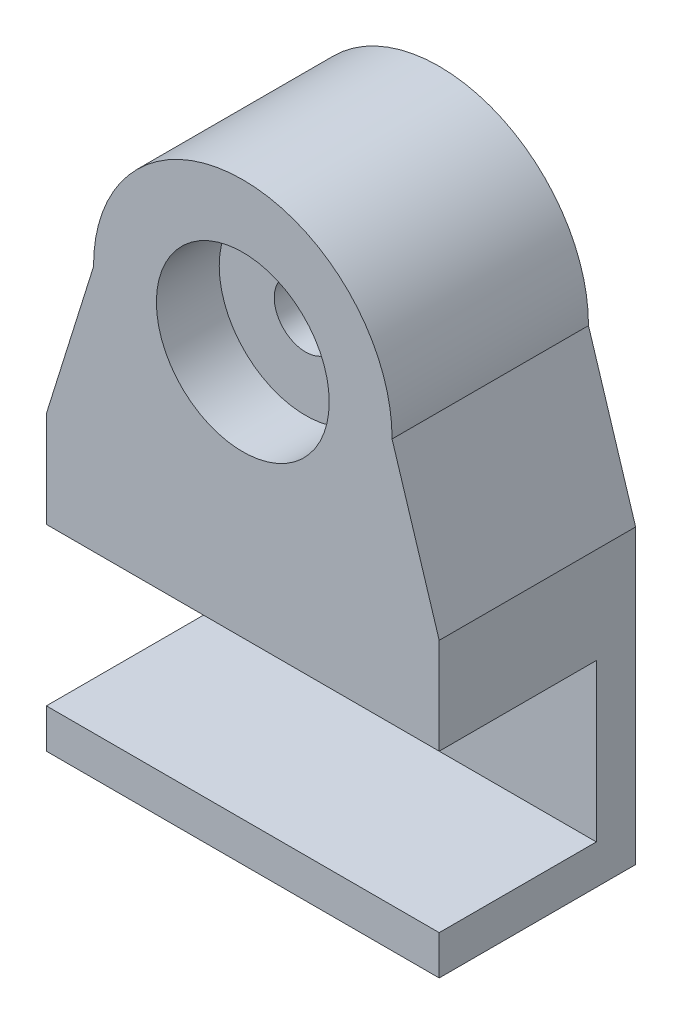
ISO-10303-21;
HEADER;
FILE_DESCRIPTION(('STEP AP214'),'2;1');
FILE_NAME('part.step','',(''),(''),'','','');
FILE_SCHEMA(('AUTOMOTIVE_DESIGN { 1 0 10303 214 1 1 1 1 }'));
ENDSEC;
DATA;
#1=APPLICATION_CONTEXT('core data for automotive mechanical design processes');
#2=APPLICATION_PROTOCOL_DEFINITION('international standard','automotive_design',2000,#1);
#3=PRODUCT_CONTEXT('',#1,'mechanical');
#4=PRODUCT('Part','Part','',(#3));
#5=PRODUCT_RELATED_PRODUCT_CATEGORY('part','',(#4));
#6=PRODUCT_DEFINITION_FORMATION('','',#4);
#7=PRODUCT_DEFINITION_CONTEXT('part definition',#1,'design');
#8=PRODUCT_DEFINITION('design','',#6,#7);
#9=PRODUCT_DEFINITION_SHAPE('','',#8);
#10=(LENGTH_UNIT() NAMED_UNIT(*) SI_UNIT(.MILLI.,.METRE.));
#11=(NAMED_UNIT(*) PLANE_ANGLE_UNIT() SI_UNIT($,.RADIAN.));
#12=(NAMED_UNIT(*) SI_UNIT($,.STERADIAN.) SOLID_ANGLE_UNIT());
#13=UNCERTAINTY_MEASURE_WITH_UNIT(LENGTH_MEASURE(1.E-05),#10,'distance_accuracy_value','');
#14=(GEOMETRIC_REPRESENTATION_CONTEXT(3) GLOBAL_UNCERTAINTY_ASSIGNED_CONTEXT((#13)) GLOBAL_UNIT_ASSIGNED_CONTEXT((#10,
#11,#12)) REPRESENTATION_CONTEXT('',''));
#15=CARTESIAN_POINT('',(0.,0.,0.));
#16=DIRECTION('',(0.,0.,1.));
#17=DIRECTION('',(1.,0.,0.));
#18=AXIS2_PLACEMENT_3D('',#15,#16,#17);
#19=CARTESIAN_POINT('',(-12.,-25.,-20.));
#20=DIRECTION('',(0.,0.,1.));
#21=DIRECTION('',(1.,0.,0.));
#22=AXIS2_PLACEMENT_3D('',#19,#20,#21);
#23=CYLINDRICAL_SURFACE('',#22,3.);
#24=CARTESIAN_POINT('',(-12.,-25.,0.));
#25=DIRECTION('',(0.,0.,1.));
#26=DIRECTION('',(1.,0.,0.));
#27=AXIS2_PLACEMENT_3D('',#24,#25,#26);
#28=CIRCLE('',#27,3.);
#29=CARTESIAN_POINT('',(-9.,-25.,0.));
#30=VERTEX_POINT('',#29);
#31=EDGE_CURVE('E201',#30,#30,#28,.T.);
#32=ORIENTED_EDGE('',*,*,#31,.F.);
#33=EDGE_LOOP('',(#32));
#34=FACE_BOUND('',#33,.T.);
#35=CARTESIAN_POINT('',(-12.,-25.,5.));
#36=DIRECTION('',(0.,0.,1.));
#37=DIRECTION('',(1.,0.,0.));
#38=AXIS2_PLACEMENT_3D('',#35,#36,#37);
#39=CIRCLE('',#38,3.);
#40=CARTESIAN_POINT('',(-9.,-25.,5.));
#41=VERTEX_POINT('',#40);
#42=EDGE_CURVE('E266',#41,#41,#39,.T.);
#43=ORIENTED_EDGE('',*,*,#42,.T.);
#44=EDGE_LOOP('',(#43));
#45=FACE_BOUND('',#44,.T.);
#46=ADVANCED_FACE('F16',(#34,#45),#23,.F.);
#47=CARTESIAN_POINT('',(10.,-25.,-20.));
#48=DIRECTION('',(0.,0.,1.));
#49=DIRECTION('',(1.,0.,0.));
#50=AXIS2_PLACEMENT_3D('',#47,#48,#49);
#51=CYLINDRICAL_SURFACE('',#50,3.);
#52=CARTESIAN_POINT('',(10.,-25.,0.));
#53=DIRECTION('',(0.,0.,1.));
#54=DIRECTION('',(1.,0.,0.));
#55=AXIS2_PLACEMENT_3D('',#52,#53,#54);
#56=CIRCLE('',#55,3.);
#57=CARTESIAN_POINT('',(13.,-25.,0.));
#58=VERTEX_POINT('',#57);
#59=EDGE_CURVE('E210',#58,#58,#56,.T.);
#60=ORIENTED_EDGE('',*,*,#59,.F.);
#61=EDGE_LOOP('',(#60));
#62=FACE_BOUND('',#61,.T.);
#63=CARTESIAN_POINT('',(10.,-25.,5.));
#64=DIRECTION('',(0.,0.,1.));
#65=DIRECTION('',(1.,0.,0.));
#66=AXIS2_PLACEMENT_3D('',#63,#64,#65);
#67=CIRCLE('',#66,3.);
#68=CARTESIAN_POINT('',(13.,-25.,5.));
#69=VERTEX_POINT('',#68);
#70=EDGE_CURVE('E41',#69,#69,#67,.T.);
#71=ORIENTED_EDGE('',*,*,#70,.T.);
#72=EDGE_LOOP('',(#71));
#73=FACE_BOUND('',#72,.T.);
#74=ADVANCED_FACE('F334',(#62,#73),#51,.F.);
#75=CARTESIAN_POINT('',(21.9999070402337,6.8182272924938,0.));
#76=DIRECTION('',(-0.954457168356131,-0.298347974307847,0.));
#77=DIRECTION('',(-0.298347974307847,0.954457168356131,0.));
#78=AXIS2_PLACEMENT_3D('',#75,#76,#77);
#79=PLANE('',#78);
#80=DIRECTION('',(0.298347974307847,-0.954457168356131,0.));
#81=VECTOR('',#80,1.);
#82=CARTESIAN_POINT('',(21.9999070402337,6.8182272924938,25.));
#83=LINE('',#82,#81);
#84=CARTESIAN_POINT('',(18.9998140804675,16.4159469948875,25.));
#85=VERTEX_POINT('',#84);
#86=CARTESIAN_POINT('',(25.,-2.77949240989983,25.));
#87=VERTEX_POINT('',#86);
#88=EDGE_CURVE('E197',#85,#87,#83,.T.);
#89=ORIENTED_EDGE('',*,*,#88,.T.);
#90=DIRECTION('',(0.,0.,1.));
#91=VECTOR('',#90,1.);
#92=CARTESIAN_POINT('',(25.,-2.77949240989983,0.));
#93=LINE('',#92,#91);
#94=CARTESIAN_POINT('',(25.,-2.77949240989983,0.));
#95=VERTEX_POINT('',#94);
#96=EDGE_CURVE('E247',#95,#87,#93,.T.);
#97=ORIENTED_EDGE('',*,*,#96,.F.);
#98=DIRECTION('',(0.298347974307847,-0.954457168356131,0.));
#99=VECTOR('',#98,1.);
#100=CARTESIAN_POINT('',(21.9999070402337,6.8182272924938,0.));
#101=LINE('',#100,#99);
#102=CARTESIAN_POINT('',(18.9998140804675,16.4159469948875,0.));
#103=VERTEX_POINT('',#102);
#104=EDGE_CURVE('E185',#103,#95,#101,.T.);
#105=ORIENTED_EDGE('',*,*,#104,.F.);
#106=DIRECTION('',(0.,0.,1.));
#107=VECTOR('',#106,1.);
#108=CARTESIAN_POINT('',(18.9998140804675,16.4159469948875,0.));
#109=LINE('',#108,#107);
#110=EDGE_CURVE('E10',#103,#85,#109,.T.);
#111=ORIENTED_EDGE('',*,*,#110,.T.);
#112=EDGE_LOOP('',(#89,#97,#105,#111));
#113=FACE_BOUND('',#112,.T.);
#114=ADVANCED_FACE('F319',(#113),#79,.F.);
#115=CARTESIAN_POINT('',(0.,16.5,0.));
#116=DIRECTION('',(0.,0.,1.));
#117=DIRECTION('',(1.,0.,0.));
#118=AXIS2_PLACEMENT_3D('',#115,#116,#117);
#119=CYLINDRICAL_SURFACE('',#118,19.);
#120=CARTESIAN_POINT('',(0.,16.5,25.));
#121=DIRECTION('',(0.,0.,1.));
#122=DIRECTION('',(1.,0.,0.));
#123=AXIS2_PLACEMENT_3D('',#120,#121,#122);
#124=CIRCLE('',#123,19.);
#125=CARTESIAN_POINT('',(-18.9998140804675,16.4159469948875,25.));
#126=VERTEX_POINT('',#125);
#127=EDGE_CURVE('E280',#85,#126,#124,.T.);
#128=ORIENTED_EDGE('',*,*,#127,.F.);
#129=ORIENTED_EDGE('',*,*,#110,.F.);
#130=CARTESIAN_POINT('',(0.,16.5,0.));
#131=DIRECTION('',(0.,0.,1.));
#132=DIRECTION('',(1.,0.,0.));
#133=AXIS2_PLACEMENT_3D('',#130,#131,#132);
#134=CIRCLE('',#133,19.);
#135=CARTESIAN_POINT('',(-18.9998140804675,16.4159469948875,0.));
#136=VERTEX_POINT('',#135);
#137=EDGE_CURVE('E219',#103,#136,#134,.T.);
#138=ORIENTED_EDGE('',*,*,#137,.T.);
#139=DIRECTION('',(0.,0.,1.));
#140=VECTOR('',#139,1.);
#141=CARTESIAN_POINT('',(-18.9998140804675,16.4159469948875,0.));
#142=LINE('',#141,#140);
#143=EDGE_CURVE('E24',#136,#126,#142,.T.);
#144=ORIENTED_EDGE('',*,*,#143,.T.);
#145=EDGE_LOOP('',(#128,#129,#138,#144));
#146=FACE_BOUND('',#145,.T.);
#147=ADVANCED_FACE('F278',(#146),#119,.T.);
#148=CARTESIAN_POINT('',(-21.9999070402337,6.8182272924938,0.));
#149=DIRECTION('',(-0.954457168356131,0.298347974307847,0.));
#150=DIRECTION('',(0.,0.,1.));
#151=AXIS2_PLACEMENT_3D('',#148,#149,#150);
#152=PLANE('',#151);
#153=DIRECTION('',(-0.298347974307847,-0.954457168356131,0.));
#154=VECTOR('',#153,1.);
#155=CARTESIAN_POINT('',(-21.9999070402337,6.8182272924938,25.));
#156=LINE('',#155,#154);
#157=CARTESIAN_POINT('',(-25.,-2.77949240989983,25.));
#158=VERTEX_POINT('',#157);
#159=EDGE_CURVE('E189',#126,#158,#156,.T.);
#160=ORIENTED_EDGE('',*,*,#159,.F.);
#161=ORIENTED_EDGE('',*,*,#143,.F.);
#162=DIRECTION('',(-0.298347974307847,-0.954457168356131,0.));
#163=VECTOR('',#162,1.);
#164=CARTESIAN_POINT('',(-21.9999070402337,6.8182272924938,0.));
#165=LINE('',#164,#163);
#166=CARTESIAN_POINT('',(-25.,-2.77949240989983,0.));
#167=VERTEX_POINT('',#166);
#168=EDGE_CURVE('E216',#136,#167,#165,.T.);
#169=ORIENTED_EDGE('',*,*,#168,.T.);
#170=DIRECTION('',(0.,0.,1.));
#171=VECTOR('',#170,1.);
#172=CARTESIAN_POINT('',(-25.,-2.77949240989983,0.));
#173=LINE('',#172,#171);
#174=EDGE_CURVE('E162',#167,#158,#173,.T.);
#175=ORIENTED_EDGE('',*,*,#174,.T.);
#176=EDGE_LOOP('',(#160,#161,#169,#175));
#177=FACE_BOUND('',#176,.T.);
#178=ADVANCED_FACE('F284',(#177),#152,.T.);
#179=CARTESIAN_POINT('',(0.,12.5,17.));
#180=DIRECTION('',(0.,0.,1.));
#181=DIRECTION('',(1.,0.,0.));
#182=AXIS2_PLACEMENT_3D('',#179,#180,#181);
#183=PLANE('',#182);
#184=CARTESIAN_POINT('',(0.,16.5,17.));
#185=DIRECTION('',(0.,0.,1.));
#186=DIRECTION('',(1.,0.,0.));
#187=AXIS2_PLACEMENT_3D('',#184,#185,#186);
#188=CIRCLE('',#187,11.);
#189=CARTESIAN_POINT('',(11.,16.5,17.));
#190=VERTEX_POINT('',#189);
#191=EDGE_CURVE('E34',#190,#190,#188,.T.);
#192=ORIENTED_EDGE('',*,*,#191,.T.);
#193=EDGE_LOOP('',(#192));
#194=FACE_BOUND('',#193,.T.);
#195=CARTESIAN_POINT('',(0.,16.5,17.));
#196=DIRECTION('',(0.,0.,1.));
#197=DIRECTION('',(1.,0.,0.));
#198=AXIS2_PLACEMENT_3D('',#195,#196,#197);
#199=CIRCLE('',#198,4.);
#200=CARTESIAN_POINT('',(4.,16.5,17.));
#201=VERTEX_POINT('',#200);
#202=EDGE_CURVE('E172',#201,#201,#199,.T.);
#203=ORIENTED_EDGE('',*,*,#202,.F.);
#204=EDGE_LOOP('',(#203));
#205=FACE_BOUND('',#204,.T.);
#206=ADVANCED_FACE('F536',(#194,#205),#183,.T.);
#207=CARTESIAN_POINT('',(0.,16.5,17.));
#208=DIRECTION('',(0.,0.,1.));
#209=DIRECTION('',(1.,0.,0.));
#210=AXIS2_PLACEMENT_3D('',#207,#208,#209);
#211=CYLINDRICAL_SURFACE('',#210,11.);
#212=CARTESIAN_POINT('',(0.,16.5,25.));
#213=DIRECTION('',(0.,0.,1.));
#214=DIRECTION('',(1.,0.,0.));
#215=AXIS2_PLACEMENT_3D('',#212,#213,#214);
#216=CIRCLE('',#215,11.);
#217=CARTESIAN_POINT('',(11.,16.5,25.));
#218=VERTEX_POINT('',#217);
#219=EDGE_CURVE('E292',#218,#218,#216,.T.);
#220=ORIENTED_EDGE('',*,*,#219,.T.);
#221=EDGE_LOOP('',(#220));
#222=FACE_BOUND('',#221,.T.);
#223=ORIENTED_EDGE('',*,*,#191,.F.);
#224=EDGE_LOOP('',(#223));
#225=FACE_BOUND('',#224,.T.);
#226=ADVANCED_FACE('F328',(#222,#225),#211,.F.);
#227=CARTESIAN_POINT('',(0.,0.,5.));
#228=DIRECTION('',(0.,0.,1.));
#229=DIRECTION('',(1.,0.,0.));
#230=AXIS2_PLACEMENT_3D('',#227,#228,#229);
#231=PLANE('',#230);
#232=DIRECTION('',(1.,0.,0.));
#233=VECTOR('',#232,1.);
#234=CARTESIAN_POINT('',(0.,-15.,5.));
#235=LINE('',#234,#233);
#236=CARTESIAN_POINT('',(-25.,-15.,5.));
#237=VERTEX_POINT('',#236);
#238=CARTESIAN_POINT('',(25.,-15.,5.));
#239=VERTEX_POINT('',#238);
#240=EDGE_CURVE('E205',#237,#239,#235,.T.);
#241=ORIENTED_EDGE('',*,*,#240,.F.);
#242=DIRECTION('',(0.,1.,0.));
#243=VECTOR('',#242,1.);
#244=CARTESIAN_POINT('',(-25.,0.,5.));
#245=LINE('',#244,#243);
#246=CARTESIAN_POINT('',(-25.,-35.,5.));
#247=VERTEX_POINT('',#246);
#248=EDGE_CURVE('E235',#247,#237,#245,.T.);
#249=ORIENTED_EDGE('',*,*,#248,.F.);
#250=DIRECTION('',(1.,0.,0.));
#251=VECTOR('',#250,1.);
#252=CARTESIAN_POINT('',(0.,-35.,5.));
#253=LINE('',#252,#251);
#254=CARTESIAN_POINT('',(25.,-35.,5.));
#255=VERTEX_POINT('',#254);
#256=EDGE_CURVE('E208',#247,#255,#253,.T.);
#257=ORIENTED_EDGE('',*,*,#256,.T.);
#258=DIRECTION('',(0.,1.,0.));
#259=VECTOR('',#258,1.);
#260=CARTESIAN_POINT('',(25.,0.,5.));
#261=LINE('',#260,#259);
#262=EDGE_CURVE('E253',#255,#239,#261,.T.);
#263=ORIENTED_EDGE('',*,*,#262,.T.);
#264=EDGE_LOOP('',(#241,#249,#257,#263));
#265=FACE_BOUND('',#264,.T.);
#266=ORIENTED_EDGE('',*,*,#70,.F.);
#267=EDGE_LOOP('',(#266));
#268=FACE_BOUND('',#267,.T.);
#269=ORIENTED_EDGE('',*,*,#42,.F.);
#270=EDGE_LOOP('',(#269));
#271=FACE_BOUND('',#270,.T.);
#272=ADVANCED_FACE('F325',(#265,#268,#271),#231,.T.);
#273=CARTESIAN_POINT('',(0.,-35.,5.));
#274=DIRECTION('',(0.,-1.,0.));
#275=DIRECTION('',(0.,0.,-1.));
#276=AXIS2_PLACEMENT_3D('',#273,#274,#275);
#277=PLANE('',#276);
#278=DIRECTION('',(1.,0.,0.));
#279=VECTOR('',#278,1.);
#280=CARTESIAN_POINT('',(0.,-35.,25.));
#281=LINE('',#280,#279);
#282=CARTESIAN_POINT('',(-25.,-35.,25.));
#283=VERTEX_POINT('',#282);
#284=CARTESIAN_POINT('',(25.,-35.,25.));
#285=VERTEX_POINT('',#284);
#286=EDGE_CURVE('E209',#283,#285,#281,.T.);
#287=ORIENTED_EDGE('',*,*,#286,.T.);
#288=DIRECTION('',(0.,0.,1.));
#289=VECTOR('',#288,1.);
#290=CARTESIAN_POINT('',(25.,-35.,5.));
#291=LINE('',#290,#289);
#292=EDGE_CURVE('E257',#255,#285,#291,.T.);
#293=ORIENTED_EDGE('',*,*,#292,.F.);
#294=ORIENTED_EDGE('',*,*,#256,.F.);
#295=DIRECTION('',(0.,0.,1.));
#296=VECTOR('',#295,1.);
#297=CARTESIAN_POINT('',(-25.,-35.,5.));
#298=LINE('',#297,#296);
#299=EDGE_CURVE('E231',#247,#283,#298,.T.);
#300=ORIENTED_EDGE('',*,*,#299,.T.);
#301=EDGE_LOOP('',(#287,#293,#294,#300));
#302=FACE_BOUND('',#301,.T.);
#303=ADVANCED_FACE('F311',(#302),#277,.F.);
#304=CARTESIAN_POINT('',(0.,-15.,5.));
#305=DIRECTION('',(0.,-1.,0.));
#306=DIRECTION('',(0.,0.,-1.));
#307=AXIS2_PLACEMENT_3D('',#304,#305,#306);
#308=PLANE('',#307);
#309=DIRECTION('',(1.,0.,0.));
#310=VECTOR('',#309,1.);
#311=CARTESIAN_POINT('',(0.,-15.,25.));
#312=LINE('',#311,#310);
#313=CARTESIAN_POINT('',(-25.,-15.,25.));
#314=VERTEX_POINT('',#313);
#315=CARTESIAN_POINT('',(25.,-15.,25.));
#316=VERTEX_POINT('',#315);
#317=EDGE_CURVE('E191',#314,#316,#312,.T.);
#318=ORIENTED_EDGE('',*,*,#317,.F.);
#319=DIRECTION('',(0.,0.,1.));
#320=VECTOR('',#319,1.);
#321=CARTESIAN_POINT('',(-25.,-15.,5.));
#322=LINE('',#321,#320);
#323=EDGE_CURVE('E239',#237,#314,#322,.T.);
#324=ORIENTED_EDGE('',*,*,#323,.F.);
#325=ORIENTED_EDGE('',*,*,#240,.T.);
#326=DIRECTION('',(0.,0.,1.));
#327=VECTOR('',#326,1.);
#328=CARTESIAN_POINT('',(25.,-15.,5.));
#329=LINE('',#328,#327);
#330=EDGE_CURVE('E250',#239,#316,#329,.T.);
#331=ORIENTED_EDGE('',*,*,#330,.T.);
#332=EDGE_LOOP('',(#318,#324,#325,#331));
#333=FACE_BOUND('',#332,.T.);
#334=ADVANCED_FACE('F322',(#333),#308,.T.);
#335=CARTESIAN_POINT('',(0.,0.,25.));
#336=DIRECTION('',(0.,0.,1.));
#337=DIRECTION('',(1.,0.,0.));
#338=AXIS2_PLACEMENT_3D('',#335,#336,#337);
#339=PLANE('',#338);
#340=ORIENTED_EDGE('',*,*,#286,.F.);
#341=DIRECTION('',(0.,1.,0.));
#342=VECTOR('',#341,1.);
#343=CARTESIAN_POINT('',(-25.,0.,25.));
#344=LINE('',#343,#342);
#345=CARTESIAN_POINT('',(-25.,-40.,25.));
#346=VERTEX_POINT('',#345);
#347=EDGE_CURVE('E161',#346,#283,#344,.T.);
#348=ORIENTED_EDGE('',*,*,#347,.F.);
#349=DIRECTION('',(-1.,0.,0.));
#350=VECTOR('',#349,1.);
#351=CARTESIAN_POINT('',(0.,-40.,25.));
#352=LINE('',#351,#350);
#353=CARTESIAN_POINT('',(25.,-40.,25.));
#354=VERTEX_POINT('',#353);
#355=EDGE_CURVE('E156',#354,#346,#352,.T.);
#356=ORIENTED_EDGE('',*,*,#355,.F.);
#357=DIRECTION('',(0.,1.,0.));
#358=VECTOR('',#357,1.);
#359=CARTESIAN_POINT('',(25.,0.,25.));
#360=LINE('',#359,#358);
#361=EDGE_CURVE('E258',#354,#285,#360,.T.);
#362=ORIENTED_EDGE('',*,*,#361,.T.);
#363=EDGE_LOOP('',(#340,#348,#356,#362));
#364=FACE_BOUND('',#363,.T.);
#365=ADVANCED_FACE('F315',(#364),#339,.T.);
#366=CARTESIAN_POINT('',(25.,0.,25.));
#367=DIRECTION('',(-1.,0.,0.));
#368=DIRECTION('',(0.,0.,1.));
#369=AXIS2_PLACEMENT_3D('',#366,#367,#368);
#370=PLANE('',#369);
#371=DIRECTION('',(0.,1.,0.));
#372=VECTOR('',#371,1.);
#373=CARTESIAN_POINT('',(25.,0.,0.));
#374=LINE('',#373,#372);
#375=CARTESIAN_POINT('',(25.,-40.,0.));
#376=VERTEX_POINT('',#375);
#377=EDGE_CURVE('E178',#376,#95,#374,.T.);
#378=ORIENTED_EDGE('',*,*,#377,.T.);
#379=ORIENTED_EDGE('',*,*,#96,.T.);
#380=DIRECTION('',(0.,1.,0.));
#381=VECTOR('',#380,1.);
#382=CARTESIAN_POINT('',(25.,0.,25.));
#383=LINE('',#382,#381);
#384=EDGE_CURVE('E195',#316,#87,#383,.T.);
#385=ORIENTED_EDGE('',*,*,#384,.F.);
#386=ORIENTED_EDGE('',*,*,#330,.F.);
#387=ORIENTED_EDGE('',*,*,#262,.F.);
#388=ORIENTED_EDGE('',*,*,#292,.T.);
#389=ORIENTED_EDGE('',*,*,#361,.F.);
#390=DIRECTION('',(0.,0.,-1.));
#391=VECTOR('',#390,1.);
#392=CARTESIAN_POINT('',(25.,-40.,25.));
#393=LINE('',#392,#391);
#394=EDGE_CURVE('E242',#354,#376,#393,.T.);
#395=ORIENTED_EDGE('',*,*,#394,.T.);
#396=EDGE_LOOP('',(#378,#379,#385,#386,#387,#388,#389,#395));
#397=FACE_BOUND('',#396,.T.);
#398=ADVANCED_FACE('F308',(#397),#370,.F.);
#399=CARTESIAN_POINT('',(0.,-40.,25.));
#400=DIRECTION('',(0.,-1.,0.));
#401=DIRECTION('',(0.,0.,-1.));
#402=AXIS2_PLACEMENT_3D('',#399,#400,#401);
#403=PLANE('',#402);
#404=DIRECTION('',(-1.,0.,0.));
#405=VECTOR('',#404,1.);
#406=CARTESIAN_POINT('',(0.,-40.,0.));
#407=LINE('',#406,#405);
#408=CARTESIAN_POINT('',(-25.,-40.,0.));
#409=VERTEX_POINT('',#408);
#410=EDGE_CURVE('E153',#376,#409,#407,.T.);
#411=ORIENTED_EDGE('',*,*,#410,.F.);
#412=ORIENTED_EDGE('',*,*,#394,.F.);
#413=ORIENTED_EDGE('',*,*,#355,.T.);
#414=DIRECTION('',(0.,0.,-1.));
#415=VECTOR('',#414,1.);
#416=CARTESIAN_POINT('',(-25.,-40.,25.));
#417=LINE('',#416,#415);
#418=EDGE_CURVE('E148',#346,#409,#417,.T.);
#419=ORIENTED_EDGE('',*,*,#418,.T.);
#420=EDGE_LOOP('',(#411,#412,#413,#419));
#421=FACE_BOUND('',#420,.T.);
#422=ADVANCED_FACE('F150',(#421),#403,.T.);
#423=CARTESIAN_POINT('',(-25.,0.,25.));
#424=DIRECTION('',(-1.,0.,0.));
#425=DIRECTION('',(0.,0.,1.));
#426=AXIS2_PLACEMENT_3D('',#423,#424,#425);
#427=PLANE('',#426);
#428=ORIENTED_EDGE('',*,*,#174,.F.);
#429=DIRECTION('',(0.,1.,0.));
#430=VECTOR('',#429,1.);
#431=CARTESIAN_POINT('',(-25.,0.,0.));
#432=LINE('',#431,#430);
#433=EDGE_CURVE('E165',#409,#167,#432,.T.);
#434=ORIENTED_EDGE('',*,*,#433,.F.);
#435=ORIENTED_EDGE('',*,*,#418,.F.);
#436=ORIENTED_EDGE('',*,*,#347,.T.);
#437=ORIENTED_EDGE('',*,*,#299,.F.);
#438=ORIENTED_EDGE('',*,*,#248,.T.);
#439=ORIENTED_EDGE('',*,*,#323,.T.);
#440=DIRECTION('',(0.,1.,0.));
#441=VECTOR('',#440,1.);
#442=CARTESIAN_POINT('',(-25.,0.,25.));
#443=LINE('',#442,#441);
#444=EDGE_CURVE('E196',#314,#158,#443,.T.);
#445=ORIENTED_EDGE('',*,*,#444,.T.);
#446=EDGE_LOOP('',(#428,#434,#435,#436,#437,#438,#439,#445));
#447=FACE_BOUND('',#446,.T.);
#448=ADVANCED_FACE('F166',(#447),#427,.T.);
#449=CARTESIAN_POINT('',(0.,16.5,25.));
#450=DIRECTION('',(0.,0.,-1.));
#451=DIRECTION('',(-1.,0.,0.));
#452=AXIS2_PLACEMENT_3D('',#449,#450,#451);
#453=CYLINDRICAL_SURFACE('',#452,4.);
#454=ORIENTED_EDGE('',*,*,#202,.T.);
#455=EDGE_LOOP('',(#454));
#456=FACE_BOUND('',#455,.T.);
#457=CARTESIAN_POINT('',(0.,16.5,0.));
#458=DIRECTION('',(0.,0.,1.));
#459=DIRECTION('',(1.,0.,0.));
#460=AXIS2_PLACEMENT_3D('',#457,#458,#459);
#461=CIRCLE('',#460,4.);
#462=CARTESIAN_POINT('',(4.,16.5,0.));
#463=VERTEX_POINT('',#462);
#464=EDGE_CURVE('E212',#463,#463,#461,.T.);
#465=ORIENTED_EDGE('',*,*,#464,.F.);
#466=EDGE_LOOP('',(#465));
#467=FACE_BOUND('',#466,.T.);
#468=ADVANCED_FACE('F471',(#456,#467),#453,.F.);
#469=CARTESIAN_POINT('',(0.,0.,0.));
#470=DIRECTION('',(0.,0.,1.));
#471=DIRECTION('',(1.,0.,0.));
#472=AXIS2_PLACEMENT_3D('',#469,#470,#471);
#473=PLANE('',#472);
#474=ORIENTED_EDGE('',*,*,#168,.F.);
#475=ORIENTED_EDGE('',*,*,#137,.F.);
#476=ORIENTED_EDGE('',*,*,#104,.T.);
#477=ORIENTED_EDGE('',*,*,#377,.F.);
#478=ORIENTED_EDGE('',*,*,#410,.T.);
#479=ORIENTED_EDGE('',*,*,#433,.T.);
#480=EDGE_LOOP('',(#474,#475,#476,#477,#478,#479));
#481=FACE_BOUND('',#480,.T.);
#482=ORIENTED_EDGE('',*,*,#464,.T.);
#483=EDGE_LOOP('',(#482));
#484=FACE_BOUND('',#483,.T.);
#485=ORIENTED_EDGE('',*,*,#59,.T.);
#486=EDGE_LOOP('',(#485));
#487=FACE_BOUND('',#486,.T.);
#488=ORIENTED_EDGE('',*,*,#31,.T.);
#489=EDGE_LOOP('',(#488));
#490=FACE_BOUND('',#489,.T.);
#491=ADVANCED_FACE('F174',(#481,#484,#487,#490),#473,.F.);
#492=CARTESIAN_POINT('',(0.,0.,25.));
#493=DIRECTION('',(0.,0.,1.));
#494=DIRECTION('',(1.,0.,0.));
#495=AXIS2_PLACEMENT_3D('',#492,#493,#494);
#496=PLANE('',#495);
#497=ORIENTED_EDGE('',*,*,#127,.T.);
#498=ORIENTED_EDGE('',*,*,#159,.T.);
#499=ORIENTED_EDGE('',*,*,#444,.F.);
#500=ORIENTED_EDGE('',*,*,#317,.T.);
#501=ORIENTED_EDGE('',*,*,#384,.T.);
#502=ORIENTED_EDGE('',*,*,#88,.F.);
#503=EDGE_LOOP('',(#497,#498,#499,#500,#501,#502));
#504=FACE_BOUND('',#503,.T.);
#505=ORIENTED_EDGE('',*,*,#219,.F.);
#506=EDGE_LOOP('',(#505));
#507=FACE_BOUND('',#506,.T.);
#508=ADVANCED_FACE('F289',(#504,#507),#496,.T.);
#509=CLOSED_SHELL('',(#46,#74,#114,#147,#178,#206,#226,#272,#303,#334,#365,#398,#422,#448,#468,
#491,#508));
#510=MANIFOLD_SOLID_BREP('B1',#509);
#511=ADVANCED_BREP_SHAPE_REPRESENTATION('',(#18,#510),#14);
#512=SHAPE_DEFINITION_REPRESENTATION(#9,#511);
ENDSEC;
END-ISO-10303-21;
